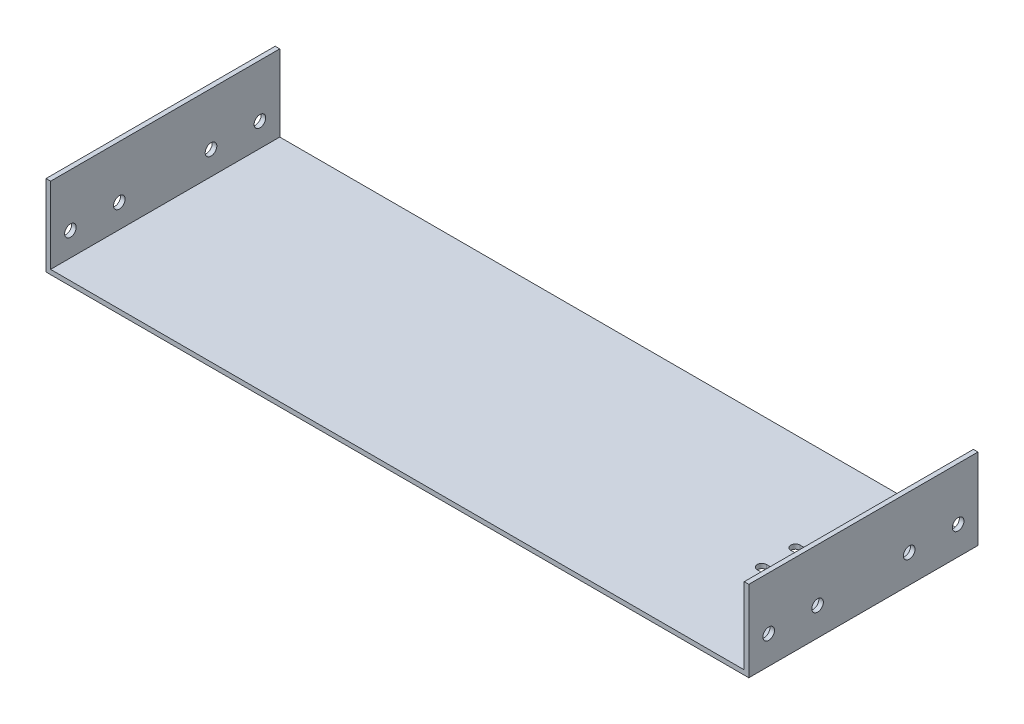
ISO-10303-21;
HEADER;
FILE_DESCRIPTION(('STEP AP214'),'2;1');
FILE_NAME('part.step','',(''),(''),'','','');
FILE_SCHEMA(('AUTOMOTIVE_DESIGN { 1 0 10303 214 1 1 1 1 }'));
ENDSEC;
DATA;
#1=APPLICATION_CONTEXT('core data for automotive mechanical design processes');
#2=APPLICATION_PROTOCOL_DEFINITION('international standard','automotive_design',2000,#1);
#3=PRODUCT_CONTEXT('',#1,'mechanical');
#4=PRODUCT('Part','Part','',(#3));
#5=PRODUCT_RELATED_PRODUCT_CATEGORY('part','',(#4));
#6=PRODUCT_DEFINITION_FORMATION('','',#4);
#7=PRODUCT_DEFINITION_CONTEXT('part definition',#1,'design');
#8=PRODUCT_DEFINITION('design','',#6,#7);
#9=PRODUCT_DEFINITION_SHAPE('','',#8);
#10=(LENGTH_UNIT() NAMED_UNIT(*) SI_UNIT(.MILLI.,.METRE.));
#11=(NAMED_UNIT(*) PLANE_ANGLE_UNIT() SI_UNIT($,.RADIAN.));
#12=(NAMED_UNIT(*) SI_UNIT($,.STERADIAN.) SOLID_ANGLE_UNIT());
#13=UNCERTAINTY_MEASURE_WITH_UNIT(LENGTH_MEASURE(1.E-05),#10,'distance_accuracy_value','');
#14=(GEOMETRIC_REPRESENTATION_CONTEXT(3) GLOBAL_UNCERTAINTY_ASSIGNED_CONTEXT((#13)) GLOBAL_UNIT_ASSIGNED_CONTEXT((#10,
#11,#12)) REPRESENTATION_CONTEXT('',''));
#15=CARTESIAN_POINT('',(0.,0.,0.));
#16=DIRECTION('',(0.,0.,1.));
#17=DIRECTION('',(1.,0.,0.));
#18=AXIS2_PLACEMENT_3D('',#15,#16,#17);
#19=CARTESIAN_POINT('',(0.,3.,0.));
#20=DIRECTION('',(0.,1.,0.));
#21=DIRECTION('',(0.,0.,1.));
#22=AXIS2_PLACEMENT_3D('',#19,#20,#21);
#23=PLANE('',#22);
#24=CARTESIAN_POINT('',(174.5,3.,11.0000000000001));
#25=DIRECTION('',(0.,1.,0.));
#26=DIRECTION('',(0.,0.,1.));
#27=AXIS2_PLACEMENT_3D('',#24,#25,#26);
#28=CIRCLE('',#27,2.99999999999999);
#29=CARTESIAN_POINT('',(174.5,3.,8.00000000000007));
#30=VERTEX_POINT('',#29);
#31=CARTESIAN_POINT('',(174.5,3.,14.0000000000001));
#32=VERTEX_POINT('',#31);
#33=EDGE_CURVE('E54',#30,#32,#28,.T.);
#34=ORIENTED_EDGE('',*,*,#33,.F.);
#35=DIRECTION('',(-1.,0.,0.));
#36=VECTOR('',#35,1.);
#37=CARTESIAN_POINT('',(0.,3.,8.00000000000007));
#38=LINE('',#37,#36);
#39=CARTESIAN_POINT('',(204.5,3.,8.00000000000007));
#40=VERTEX_POINT('',#39);
#41=EDGE_CURVE('E177',#40,#30,#38,.T.);
#42=ORIENTED_EDGE('',*,*,#41,.F.);
#43=CARTESIAN_POINT('',(204.5,3.,11.0000000000001));
#44=DIRECTION('',(0.,1.,0.));
#45=DIRECTION('',(0.,0.,1.));
#46=AXIS2_PLACEMENT_3D('',#43,#44,#45);
#47=CIRCLE('',#46,2.99999999999999);
#48=CARTESIAN_POINT('',(204.5,3.,14.0000000000001));
#49=VERTEX_POINT('',#48);
#50=EDGE_CURVE('E159',#49,#40,#47,.T.);
#51=ORIENTED_EDGE('',*,*,#50,.F.);
#52=DIRECTION('',(-1.,0.,0.));
#53=VECTOR('',#52,1.);
#54=CARTESIAN_POINT('',(0.,3.,14.0000000000001));
#55=LINE('',#54,#53);
#56=EDGE_CURVE('E170',#49,#32,#55,.T.);
#57=ORIENTED_EDGE('',*,*,#56,.T.);
#58=EDGE_LOOP('',(#34,#42,#51,#57));
#59=FACE_BOUND('',#58,.T.);
#60=CARTESIAN_POINT('',(204.5,3.,-10.9999999999999));
#61=DIRECTION('',(0.,1.,0.));
#62=DIRECTION('',(0.,0.,1.));
#63=AXIS2_PLACEMENT_3D('',#60,#61,#62);
#64=CIRCLE('',#63,3.00000000000002);
#65=CARTESIAN_POINT('',(204.5,3.,-7.99999999999994));
#66=VERTEX_POINT('',#65);
#67=CARTESIAN_POINT('',(204.5,3.,-13.9999999999999));
#68=VERTEX_POINT('',#67);
#69=EDGE_CURVE('E62',#66,#68,#64,.T.);
#70=ORIENTED_EDGE('',*,*,#69,.F.);
#71=DIRECTION('',(1.,0.,0.));
#72=VECTOR('',#71,1.);
#73=CARTESIAN_POINT('',(0.,3.,-7.99999999999994));
#74=LINE('',#73,#72);
#75=CARTESIAN_POINT('',(174.5,3.,-7.99999999999994));
#76=VERTEX_POINT('',#75);
#77=EDGE_CURVE('E202',#76,#66,#74,.T.);
#78=ORIENTED_EDGE('',*,*,#77,.F.);
#79=CARTESIAN_POINT('',(174.5,3.,-10.9999999999999));
#80=DIRECTION('',(0.,1.,0.));
#81=DIRECTION('',(0.,0.,1.));
#82=AXIS2_PLACEMENT_3D('',#79,#80,#81);
#83=CIRCLE('',#82,3.00000000000002);
#84=CARTESIAN_POINT('',(174.5,3.,-13.9999999999999));
#85=VERTEX_POINT('',#84);
#86=EDGE_CURVE('E198',#85,#76,#83,.T.);
#87=ORIENTED_EDGE('',*,*,#86,.F.);
#88=DIRECTION('',(1.,0.,0.));
#89=VECTOR('',#88,1.);
#90=CARTESIAN_POINT('',(0.,3.,-13.9999999999999));
#91=LINE('',#90,#89);
#92=EDGE_CURVE('E194',#85,#68,#91,.T.);
#93=ORIENTED_EDGE('',*,*,#92,.T.);
#94=EDGE_LOOP('',(#70,#78,#87,#93));
#95=FACE_BOUND('',#94,.T.);
#96=DIRECTION('',(1.,0.,0.));
#97=VECTOR('',#96,1.);
#98=CARTESIAN_POINT('',(-230.,3.,75.));
#99=LINE('',#98,#97);
#100=CARTESIAN_POINT('',(-227.,3.,75.));
#101=VERTEX_POINT('',#100);
#102=CARTESIAN_POINT('',(227.,3.,75.));
#103=VERTEX_POINT('',#102);
#104=EDGE_CURVE('E325',#101,#103,#99,.T.);
#105=ORIENTED_EDGE('',*,*,#104,.T.);
#106=DIRECTION('',(0.,0.,1.));
#107=VECTOR('',#106,1.);
#108=CARTESIAN_POINT('',(227.,3.,-75.));
#109=LINE('',#108,#107);
#110=CARTESIAN_POINT('',(227.,3.,-75.));
#111=VERTEX_POINT('',#110);
#112=EDGE_CURVE('E269',#111,#103,#109,.T.);
#113=ORIENTED_EDGE('',*,*,#112,.F.);
#114=DIRECTION('',(-1.,0.,0.));
#115=VECTOR('',#114,1.);
#116=CARTESIAN_POINT('',(-230.,3.,-75.));
#117=LINE('',#116,#115);
#118=CARTESIAN_POINT('',(-227.,3.,-75.));
#119=VERTEX_POINT('',#118);
#120=EDGE_CURVE('E322',#111,#119,#117,.T.);
#121=ORIENTED_EDGE('',*,*,#120,.T.);
#122=DIRECTION('',(0.,0.,-1.));
#123=VECTOR('',#122,1.);
#124=CARTESIAN_POINT('',(-227.,3.,-75.));
#125=LINE('',#124,#123);
#126=EDGE_CURVE('E295',#101,#119,#125,.T.);
#127=ORIENTED_EDGE('',*,*,#126,.F.);
#128=EDGE_LOOP('',(#105,#113,#121,#127));
#129=FACE_BOUND('',#128,.T.);
#130=ADVANCED_FACE('F38',(#59,#95,#129),#23,.T.);
#131=CARTESIAN_POINT('',(230.,3.,-75.));
#132=DIRECTION('',(-1.,0.,0.));
#133=DIRECTION('',(0.,0.,1.));
#134=AXIS2_PLACEMENT_3D('',#131,#132,#133);
#135=PLANE('',#134);
#136=CARTESIAN_POINT('',(230.,18.5,-62.));
#137=DIRECTION('',(1.,0.,0.));
#138=DIRECTION('',(0.,0.,-1.));
#139=AXIS2_PLACEMENT_3D('',#136,#137,#138);
#140=CIRCLE('',#139,3.79999999999999);
#141=CARTESIAN_POINT('',(230.,18.5,-65.8));
#142=VERTEX_POINT('',#141);
#143=EDGE_CURVE('E218',#142,#142,#140,.T.);
#144=ORIENTED_EDGE('',*,*,#143,.F.);
#145=EDGE_LOOP('',(#144));
#146=FACE_BOUND('',#145,.T.);
#147=CARTESIAN_POINT('',(230.,18.5,30.));
#148=DIRECTION('',(1.,0.,0.));
#149=DIRECTION('',(0.,0.,-1.));
#150=AXIS2_PLACEMENT_3D('',#147,#148,#149);
#151=CIRCLE('',#150,3.79999999999999);
#152=CARTESIAN_POINT('',(230.,18.5,26.2));
#153=VERTEX_POINT('',#152);
#154=EDGE_CURVE('E187',#153,#153,#151,.T.);
#155=ORIENTED_EDGE('',*,*,#154,.F.);
#156=EDGE_LOOP('',(#155));
#157=FACE_BOUND('',#156,.T.);
#158=CARTESIAN_POINT('',(230.,18.5,62.));
#159=DIRECTION('',(1.,0.,0.));
#160=DIRECTION('',(0.,0.,-1.));
#161=AXIS2_PLACEMENT_3D('',#158,#159,#160);
#162=CIRCLE('',#161,3.79999999999998);
#163=CARTESIAN_POINT('',(230.,18.5,58.2));
#164=VERTEX_POINT('',#163);
#165=EDGE_CURVE('E235',#164,#164,#162,.T.);
#166=ORIENTED_EDGE('',*,*,#165,.F.);
#167=EDGE_LOOP('',(#166));
#168=FACE_BOUND('',#167,.T.);
#169=CARTESIAN_POINT('',(230.,18.5,-30.));
#170=DIRECTION('',(1.,0.,0.));
#171=DIRECTION('',(0.,0.,-1.));
#172=AXIS2_PLACEMENT_3D('',#169,#170,#171);
#173=CIRCLE('',#172,3.79999999999999);
#174=CARTESIAN_POINT('',(230.,18.5,-33.8));
#175=VERTEX_POINT('',#174);
#176=EDGE_CURVE('E236',#175,#175,#173,.T.);
#177=ORIENTED_EDGE('',*,*,#176,.F.);
#178=EDGE_LOOP('',(#177));
#179=FACE_BOUND('',#178,.T.);
#180=DIRECTION('',(0.,0.,-1.));
#181=VECTOR('',#180,1.);
#182=CARTESIAN_POINT('',(230.,0.,-75.));
#183=LINE('',#182,#181);
#184=CARTESIAN_POINT('',(230.,0.,75.));
#185=VERTEX_POINT('',#184);
#186=CARTESIAN_POINT('',(230.,0.,-75.));
#187=VERTEX_POINT('',#186);
#188=EDGE_CURVE('E321',#185,#187,#183,.T.);
#189=ORIENTED_EDGE('',*,*,#188,.T.);
#190=DIRECTION('',(0.,-1.,0.));
#191=VECTOR('',#190,1.);
#192=CARTESIAN_POINT('',(230.,3.,-75.));
#193=LINE('',#192,#191);
#194=CARTESIAN_POINT('',(230.,53.,-75.));
#195=VERTEX_POINT('',#194);
#196=EDGE_CURVE('E352',#195,#187,#193,.T.);
#197=ORIENTED_EDGE('',*,*,#196,.F.);
#198=DIRECTION('',(0.,0.,-1.));
#199=VECTOR('',#198,1.);
#200=CARTESIAN_POINT('',(230.,53.,-75.));
#201=LINE('',#200,#199);
#202=CARTESIAN_POINT('',(230.,53.,75.));
#203=VERTEX_POINT('',#202);
#204=EDGE_CURVE('E270',#203,#195,#201,.T.);
#205=ORIENTED_EDGE('',*,*,#204,.F.);
#206=DIRECTION('',(0.,-1.,0.));
#207=VECTOR('',#206,1.);
#208=CARTESIAN_POINT('',(230.,3.,75.));
#209=LINE('',#208,#207);
#210=EDGE_CURVE('E329',#203,#185,#209,.T.);
#211=ORIENTED_EDGE('',*,*,#210,.T.);
#212=EDGE_LOOP('',(#189,#197,#205,#211));
#213=FACE_BOUND('',#212,.T.);
#214=ADVANCED_FACE('F40',(#146,#157,#168,#179,#213),#135,.F.);
#215=CARTESIAN_POINT('',(-230.,3.,-75.));
#216=DIRECTION('',(0.,0.,1.));
#217=DIRECTION('',(1.,0.,0.));
#218=AXIS2_PLACEMENT_3D('',#215,#216,#217);
#219=PLANE('',#218);
#220=DIRECTION('',(-1.,0.,0.));
#221=VECTOR('',#220,1.);
#222=CARTESIAN_POINT('',(-230.,0.,-75.));
#223=LINE('',#222,#221);
#224=CARTESIAN_POINT('',(-230.,0.,-75.));
#225=VERTEX_POINT('',#224);
#226=EDGE_CURVE('E333',#187,#225,#223,.T.);
#227=ORIENTED_EDGE('',*,*,#226,.T.);
#228=DIRECTION('',(0.,-1.,0.));
#229=VECTOR('',#228,1.);
#230=CARTESIAN_POINT('',(-230.,3.,-75.));
#231=LINE('',#230,#229);
#232=CARTESIAN_POINT('',(-230.,53.,-75.));
#233=VERTEX_POINT('',#232);
#234=EDGE_CURVE('E348',#233,#225,#231,.T.);
#235=ORIENTED_EDGE('',*,*,#234,.F.);
#236=DIRECTION('',(-1.,0.,0.));
#237=VECTOR('',#236,1.);
#238=CARTESIAN_POINT('',(-230.,53.,-75.));
#239=LINE('',#238,#237);
#240=CARTESIAN_POINT('',(-227.,53.,-75.));
#241=VERTEX_POINT('',#240);
#242=EDGE_CURVE('E306',#241,#233,#239,.T.);
#243=ORIENTED_EDGE('',*,*,#242,.F.);
#244=DIRECTION('',(0.,-1.,0.));
#245=VECTOR('',#244,1.);
#246=CARTESIAN_POINT('',(-227.,53.,-75.));
#247=LINE('',#246,#245);
#248=EDGE_CURVE('E310',#241,#119,#247,.T.);
#249=ORIENTED_EDGE('',*,*,#248,.T.);
#250=ORIENTED_EDGE('',*,*,#120,.F.);
#251=DIRECTION('',(0.,-1.,0.));
#252=VECTOR('',#251,1.);
#253=CARTESIAN_POINT('',(227.,53.,-75.));
#254=LINE('',#253,#252);
#255=CARTESIAN_POINT('',(227.,53.,-75.));
#256=VERTEX_POINT('',#255);
#257=EDGE_CURVE('E291',#256,#111,#254,.T.);
#258=ORIENTED_EDGE('',*,*,#257,.F.);
#259=DIRECTION('',(-1.,0.,0.));
#260=VECTOR('',#259,1.);
#261=CARTESIAN_POINT('',(230.,53.,-75.));
#262=LINE('',#261,#260);
#263=EDGE_CURVE('E274',#195,#256,#262,.T.);
#264=ORIENTED_EDGE('',*,*,#263,.F.);
#265=ORIENTED_EDGE('',*,*,#196,.T.);
#266=EDGE_LOOP('',(#227,#235,#243,#249,#250,#258,#264,#265));
#267=FACE_BOUND('',#266,.T.);
#268=ADVANCED_FACE('F416',(#267),#219,.F.);
#269=CARTESIAN_POINT('',(-230.,3.,-75.));
#270=DIRECTION('',(1.,0.,0.));
#271=DIRECTION('',(0.,0.,-1.));
#272=AXIS2_PLACEMENT_3D('',#269,#270,#271);
#273=PLANE('',#272);
#274=CARTESIAN_POINT('',(-230.,18.5,-62.));
#275=DIRECTION('',(1.,0.,0.));
#276=DIRECTION('',(0.,0.,-1.));
#277=AXIS2_PLACEMENT_3D('',#274,#275,#276);
#278=CIRCLE('',#277,3.79999999999999);
#279=CARTESIAN_POINT('',(-230.,18.5,-65.8));
#280=VERTEX_POINT('',#279);
#281=EDGE_CURVE('E222',#280,#280,#278,.T.);
#282=ORIENTED_EDGE('',*,*,#281,.T.);
#283=EDGE_LOOP('',(#282));
#284=FACE_BOUND('',#283,.T.);
#285=CARTESIAN_POINT('',(-230.,18.5,30.));
#286=DIRECTION('',(1.,0.,0.));
#287=DIRECTION('',(0.,0.,-1.));
#288=AXIS2_PLACEMENT_3D('',#285,#286,#287);
#289=CIRCLE('',#288,3.79999999999999);
#290=CARTESIAN_POINT('',(-230.,18.5,26.2));
#291=VERTEX_POINT('',#290);
#292=EDGE_CURVE('E231',#291,#291,#289,.T.);
#293=ORIENTED_EDGE('',*,*,#292,.T.);
#294=EDGE_LOOP('',(#293));
#295=FACE_BOUND('',#294,.T.);
#296=CARTESIAN_POINT('',(-230.,18.5,62.));
#297=DIRECTION('',(1.,0.,0.));
#298=DIRECTION('',(0.,0.,-1.));
#299=AXIS2_PLACEMENT_3D('',#296,#297,#298);
#300=CIRCLE('',#299,3.79999999999998);
#301=CARTESIAN_POINT('',(-230.,18.5,58.2));
#302=VERTEX_POINT('',#301);
#303=EDGE_CURVE('E240',#302,#302,#300,.T.);
#304=ORIENTED_EDGE('',*,*,#303,.T.);
#305=EDGE_LOOP('',(#304));
#306=FACE_BOUND('',#305,.T.);
#307=CARTESIAN_POINT('',(-230.,18.5,-30.));
#308=DIRECTION('',(1.,0.,0.));
#309=DIRECTION('',(0.,0.,-1.));
#310=AXIS2_PLACEMENT_3D('',#307,#308,#309);
#311=CIRCLE('',#310,3.79999999999999);
#312=CARTESIAN_POINT('',(-230.,18.5,-33.8));
#313=VERTEX_POINT('',#312);
#314=EDGE_CURVE('E223',#313,#313,#311,.T.);
#315=ORIENTED_EDGE('',*,*,#314,.T.);
#316=EDGE_LOOP('',(#315));
#317=FACE_BOUND('',#316,.T.);
#318=DIRECTION('',(0.,0.,1.));
#319=VECTOR('',#318,1.);
#320=CARTESIAN_POINT('',(-230.,0.,-75.));
#321=LINE('',#320,#319);
#322=CARTESIAN_POINT('',(-230.,0.,75.));
#323=VERTEX_POINT('',#322);
#324=EDGE_CURVE('E336',#225,#323,#321,.T.);
#325=ORIENTED_EDGE('',*,*,#324,.T.);
#326=DIRECTION('',(0.,-1.,0.));
#327=VECTOR('',#326,1.);
#328=CARTESIAN_POINT('',(-230.,3.,75.));
#329=LINE('',#328,#327);
#330=CARTESIAN_POINT('',(-230.,53.,75.));
#331=VERTEX_POINT('',#330);
#332=EDGE_CURVE('E344',#331,#323,#329,.T.);
#333=ORIENTED_EDGE('',*,*,#332,.F.);
#334=DIRECTION('',(0.,0.,1.));
#335=VECTOR('',#334,1.);
#336=CARTESIAN_POINT('',(-230.,53.,-75.));
#337=LINE('',#336,#335);
#338=EDGE_CURVE('E296',#233,#331,#337,.T.);
#339=ORIENTED_EDGE('',*,*,#338,.F.);
#340=ORIENTED_EDGE('',*,*,#234,.T.);
#341=EDGE_LOOP('',(#325,#333,#339,#340));
#342=FACE_BOUND('',#341,.T.);
#343=ADVANCED_FACE('F426',(#284,#295,#306,#317,#342),#273,.F.);
#344=CARTESIAN_POINT('',(-230.,3.,75.));
#345=DIRECTION('',(0.,0.,-1.));
#346=DIRECTION('',(-1.,0.,0.));
#347=AXIS2_PLACEMENT_3D('',#344,#345,#346);
#348=PLANE('',#347);
#349=DIRECTION('',(1.,0.,0.));
#350=VECTOR('',#349,1.);
#351=CARTESIAN_POINT('',(-230.,0.,75.));
#352=LINE('',#351,#350);
#353=EDGE_CURVE('E326',#323,#185,#352,.T.);
#354=ORIENTED_EDGE('',*,*,#353,.T.);
#355=ORIENTED_EDGE('',*,*,#210,.F.);
#356=DIRECTION('',(1.,0.,0.));
#357=VECTOR('',#356,1.);
#358=CARTESIAN_POINT('',(230.,53.,75.));
#359=LINE('',#358,#357);
#360=CARTESIAN_POINT('',(227.,53.,75.));
#361=VERTEX_POINT('',#360);
#362=EDGE_CURVE('E280',#361,#203,#359,.T.);
#363=ORIENTED_EDGE('',*,*,#362,.F.);
#364=DIRECTION('',(0.,-1.,0.));
#365=VECTOR('',#364,1.);
#366=CARTESIAN_POINT('',(227.,53.,75.));
#367=LINE('',#366,#365);
#368=EDGE_CURVE('E284',#361,#103,#367,.T.);
#369=ORIENTED_EDGE('',*,*,#368,.T.);
#370=ORIENTED_EDGE('',*,*,#104,.F.);
#371=DIRECTION('',(0.,-1.,0.));
#372=VECTOR('',#371,1.);
#373=CARTESIAN_POINT('',(-227.,53.,75.));
#374=LINE('',#373,#372);
#375=CARTESIAN_POINT('',(-227.,53.,75.));
#376=VERTEX_POINT('',#375);
#377=EDGE_CURVE('E317',#376,#101,#374,.T.);
#378=ORIENTED_EDGE('',*,*,#377,.F.);
#379=DIRECTION('',(1.,0.,0.));
#380=VECTOR('',#379,1.);
#381=CARTESIAN_POINT('',(-230.,53.,75.));
#382=LINE('',#381,#380);
#383=EDGE_CURVE('E300',#331,#376,#382,.T.);
#384=ORIENTED_EDGE('',*,*,#383,.F.);
#385=ORIENTED_EDGE('',*,*,#332,.T.);
#386=EDGE_LOOP('',(#354,#355,#363,#369,#370,#378,#384,#385));
#387=FACE_BOUND('',#386,.T.);
#388=ADVANCED_FACE('F423',(#387),#348,.F.);
#389=CARTESIAN_POINT('',(0.,0.,0.));
#390=DIRECTION('',(0.,1.,0.));
#391=DIRECTION('',(0.,0.,1.));
#392=AXIS2_PLACEMENT_3D('',#389,#390,#391);
#393=PLANE('',#392);
#394=DIRECTION('',(-1.,0.,0.));
#395=VECTOR('',#394,1.);
#396=CARTESIAN_POINT('',(0.,0.,8.00000000000007));
#397=LINE('',#396,#395);
#398=CARTESIAN_POINT('',(204.5,0.,8.00000000000007));
#399=VERTEX_POINT('',#398);
#400=CARTESIAN_POINT('',(174.5,0.,8.00000000000007));
#401=VERTEX_POINT('',#400);
#402=EDGE_CURVE('E47',#399,#401,#397,.T.);
#403=ORIENTED_EDGE('',*,*,#402,.T.);
#404=CARTESIAN_POINT('',(174.5,0.,11.0000000000001));
#405=DIRECTION('',(0.,1.,0.));
#406=DIRECTION('',(0.,0.,1.));
#407=AXIS2_PLACEMENT_3D('',#404,#405,#406);
#408=CIRCLE('',#407,2.99999999999999);
#409=CARTESIAN_POINT('',(174.5,0.,14.0000000000001));
#410=VERTEX_POINT('',#409);
#411=EDGE_CURVE('E11',#401,#410,#408,.T.);
#412=ORIENTED_EDGE('',*,*,#411,.T.);
#413=DIRECTION('',(-1.,0.,0.));
#414=VECTOR('',#413,1.);
#415=CARTESIAN_POINT('',(0.,0.,14.0000000000001));
#416=LINE('',#415,#414);
#417=CARTESIAN_POINT('',(204.5,0.,14.0000000000001));
#418=VERTEX_POINT('',#417);
#419=EDGE_CURVE('E383',#418,#410,#416,.T.);
#420=ORIENTED_EDGE('',*,*,#419,.F.);
#421=CARTESIAN_POINT('',(204.5,0.,11.0000000000001));
#422=DIRECTION('',(0.,1.,0.));
#423=DIRECTION('',(0.,0.,1.));
#424=AXIS2_PLACEMENT_3D('',#421,#422,#423);
#425=CIRCLE('',#424,2.99999999999999);
#426=EDGE_CURVE('E162',#418,#399,#425,.T.);
#427=ORIENTED_EDGE('',*,*,#426,.T.);
#428=EDGE_LOOP('',(#403,#412,#420,#427));
#429=FACE_BOUND('',#428,.T.);
#430=DIRECTION('',(1.,0.,0.));
#431=VECTOR('',#430,1.);
#432=CARTESIAN_POINT('',(0.,0.,-7.99999999999994));
#433=LINE('',#432,#431);
#434=CARTESIAN_POINT('',(174.5,0.,-7.99999999999994));
#435=VERTEX_POINT('',#434);
#436=CARTESIAN_POINT('',(204.5,0.,-7.99999999999994));
#437=VERTEX_POINT('',#436);
#438=EDGE_CURVE('E375',#435,#437,#433,.T.);
#439=ORIENTED_EDGE('',*,*,#438,.T.);
#440=CARTESIAN_POINT('',(204.5,0.,-10.9999999999999));
#441=DIRECTION('',(0.,1.,0.));
#442=DIRECTION('',(0.,0.,1.));
#443=AXIS2_PLACEMENT_3D('',#440,#441,#442);
#444=CIRCLE('',#443,3.00000000000002);
#445=CARTESIAN_POINT('',(204.5,0.,-13.9999999999999));
#446=VERTEX_POINT('',#445);
#447=EDGE_CURVE('E379',#437,#446,#444,.T.);
#448=ORIENTED_EDGE('',*,*,#447,.T.);
#449=DIRECTION('',(1.,0.,0.));
#450=VECTOR('',#449,1.);
#451=CARTESIAN_POINT('',(0.,0.,-13.9999999999999));
#452=LINE('',#451,#450);
#453=CARTESIAN_POINT('',(174.5,0.,-13.9999999999999));
#454=VERTEX_POINT('',#453);
#455=EDGE_CURVE('E356',#454,#446,#452,.T.);
#456=ORIENTED_EDGE('',*,*,#455,.F.);
#457=CARTESIAN_POINT('',(174.5,0.,-10.9999999999999));
#458=DIRECTION('',(0.,1.,0.));
#459=DIRECTION('',(0.,0.,1.));
#460=AXIS2_PLACEMENT_3D('',#457,#458,#459);
#461=CIRCLE('',#460,3.00000000000002);
#462=EDGE_CURVE('E371',#454,#435,#461,.T.);
#463=ORIENTED_EDGE('',*,*,#462,.T.);
#464=EDGE_LOOP('',(#439,#448,#456,#463));
#465=FACE_BOUND('',#464,.T.);
#466=ORIENTED_EDGE('',*,*,#188,.F.);
#467=ORIENTED_EDGE('',*,*,#353,.F.);
#468=ORIENTED_EDGE('',*,*,#324,.F.);
#469=ORIENTED_EDGE('',*,*,#226,.F.);
#470=EDGE_LOOP('',(#466,#467,#468,#469));
#471=FACE_BOUND('',#470,.T.);
#472=ADVANCED_FACE('F390',(#429,#465,#471),#393,.F.);
#473=CARTESIAN_POINT('',(-227.,53.,-75.));
#474=DIRECTION('',(-1.,0.,0.));
#475=DIRECTION('',(0.,0.,1.));
#476=AXIS2_PLACEMENT_3D('',#473,#474,#475);
#477=PLANE('',#476);
#478=CARTESIAN_POINT('',(-227.,18.5,-62.));
#479=DIRECTION('',(-1.,0.,0.));
#480=DIRECTION('',(0.,0.,1.));
#481=AXIS2_PLACEMENT_3D('',#478,#479,#480);
#482=CIRCLE('',#481,3.79999999999999);
#483=CARTESIAN_POINT('',(-227.,18.5,-58.2000000000001));
#484=VERTEX_POINT('',#483);
#485=EDGE_CURVE('E265',#484,#484,#482,.T.);
#486=ORIENTED_EDGE('',*,*,#485,.T.);
#487=EDGE_LOOP('',(#486));
#488=FACE_BOUND('',#487,.T.);
#489=CARTESIAN_POINT('',(-227.,18.5,30.));
#490=DIRECTION('',(-1.,0.,0.));
#491=DIRECTION('',(0.,0.,1.));
#492=AXIS2_PLACEMENT_3D('',#489,#490,#491);
#493=CIRCLE('',#492,3.79999999999999);
#494=CARTESIAN_POINT('',(-227.,18.5,33.8));
#495=VERTEX_POINT('',#494);
#496=EDGE_CURVE('E260',#495,#495,#493,.T.);
#497=ORIENTED_EDGE('',*,*,#496,.T.);
#498=EDGE_LOOP('',(#497));
#499=FACE_BOUND('',#498,.T.);
#500=CARTESIAN_POINT('',(-227.,18.5,62.));
#501=DIRECTION('',(-1.,0.,0.));
#502=DIRECTION('',(0.,0.,1.));
#503=AXIS2_PLACEMENT_3D('',#500,#501,#502);
#504=CIRCLE('',#503,3.79999999999998);
#505=CARTESIAN_POINT('',(-227.,18.5,65.8));
#506=VERTEX_POINT('',#505);
#507=EDGE_CURVE('E255',#506,#506,#504,.T.);
#508=ORIENTED_EDGE('',*,*,#507,.T.);
#509=EDGE_LOOP('',(#508));
#510=FACE_BOUND('',#509,.T.);
#511=CARTESIAN_POINT('',(-227.,18.5,-30.));
#512=DIRECTION('',(-1.,0.,0.));
#513=DIRECTION('',(0.,0.,1.));
#514=AXIS2_PLACEMENT_3D('',#511,#512,#513);
#515=CIRCLE('',#514,3.79999999999999);
#516=CARTESIAN_POINT('',(-227.,18.5,-26.2));
#517=VERTEX_POINT('',#516);
#518=EDGE_CURVE('E250',#517,#517,#515,.T.);
#519=ORIENTED_EDGE('',*,*,#518,.T.);
#520=EDGE_LOOP('',(#519));
#521=FACE_BOUND('',#520,.T.);
#522=ORIENTED_EDGE('',*,*,#126,.T.);
#523=ORIENTED_EDGE('',*,*,#248,.F.);
#524=DIRECTION('',(0.,0.,-1.));
#525=VECTOR('',#524,1.);
#526=CARTESIAN_POINT('',(-227.,53.,-75.));
#527=LINE('',#526,#525);
#528=EDGE_CURVE('E303',#376,#241,#527,.T.);
#529=ORIENTED_EDGE('',*,*,#528,.F.);
#530=ORIENTED_EDGE('',*,*,#377,.T.);
#531=EDGE_LOOP('',(#522,#523,#529,#530));
#532=FACE_BOUND('',#531,.T.);
#533=ADVANCED_FACE('F420',(#488,#499,#510,#521,#532),#477,.F.);
#534=CARTESIAN_POINT('',(0.,53.,0.));
#535=DIRECTION('',(0.,1.,0.));
#536=DIRECTION('',(0.,0.,1.));
#537=AXIS2_PLACEMENT_3D('',#534,#535,#536);
#538=PLANE('',#537);
#539=ORIENTED_EDGE('',*,*,#338,.T.);
#540=ORIENTED_EDGE('',*,*,#383,.T.);
#541=ORIENTED_EDGE('',*,*,#528,.T.);
#542=ORIENTED_EDGE('',*,*,#242,.T.);
#543=EDGE_LOOP('',(#539,#540,#541,#542));
#544=FACE_BOUND('',#543,.T.);
#545=ADVANCED_FACE('F463',(#544),#538,.T.);
#546=CARTESIAN_POINT('',(227.,53.,-75.));
#547=DIRECTION('',(1.,0.,0.));
#548=DIRECTION('',(0.,0.,-1.));
#549=AXIS2_PLACEMENT_3D('',#546,#547,#548);
#550=PLANE('',#549);
#551=CARTESIAN_POINT('',(227.,18.5,-62.));
#552=DIRECTION('',(1.,0.,0.));
#553=DIRECTION('',(0.,0.,-1.));
#554=AXIS2_PLACEMENT_3D('',#551,#552,#553);
#555=CIRCLE('',#554,3.79999999999999);
#556=CARTESIAN_POINT('',(227.,18.5,-65.8));
#557=VERTEX_POINT('',#556);
#558=EDGE_CURVE('E264',#557,#557,#555,.T.);
#559=ORIENTED_EDGE('',*,*,#558,.T.);
#560=EDGE_LOOP('',(#559));
#561=FACE_BOUND('',#560,.T.);
#562=CARTESIAN_POINT('',(227.,18.5,30.));
#563=DIRECTION('',(1.,0.,0.));
#564=DIRECTION('',(0.,0.,-1.));
#565=AXIS2_PLACEMENT_3D('',#562,#563,#564);
#566=CIRCLE('',#565,3.79999999999999);
#567=CARTESIAN_POINT('',(227.,18.5,26.2));
#568=VERTEX_POINT('',#567);
#569=EDGE_CURVE('E259',#568,#568,#566,.T.);
#570=ORIENTED_EDGE('',*,*,#569,.T.);
#571=EDGE_LOOP('',(#570));
#572=FACE_BOUND('',#571,.T.);
#573=CARTESIAN_POINT('',(227.,18.5,62.));
#574=DIRECTION('',(1.,0.,0.));
#575=DIRECTION('',(0.,0.,-1.));
#576=AXIS2_PLACEMENT_3D('',#573,#574,#575);
#577=CIRCLE('',#576,3.79999999999998);
#578=CARTESIAN_POINT('',(227.,18.5,58.2));
#579=VERTEX_POINT('',#578);
#580=EDGE_CURVE('E254',#579,#579,#577,.T.);
#581=ORIENTED_EDGE('',*,*,#580,.T.);
#582=EDGE_LOOP('',(#581));
#583=FACE_BOUND('',#582,.T.);
#584=CARTESIAN_POINT('',(227.,18.5,-30.));
#585=DIRECTION('',(1.,0.,0.));
#586=DIRECTION('',(0.,0.,-1.));
#587=AXIS2_PLACEMENT_3D('',#584,#585,#586);
#588=CIRCLE('',#587,3.79999999999999);
#589=CARTESIAN_POINT('',(227.,18.5,-33.8));
#590=VERTEX_POINT('',#589);
#591=EDGE_CURVE('E227',#590,#590,#588,.T.);
#592=ORIENTED_EDGE('',*,*,#591,.T.);
#593=EDGE_LOOP('',(#592));
#594=FACE_BOUND('',#593,.T.);
#595=ORIENTED_EDGE('',*,*,#112,.T.);
#596=ORIENTED_EDGE('',*,*,#368,.F.);
#597=DIRECTION('',(0.,0.,1.));
#598=VECTOR('',#597,1.);
#599=CARTESIAN_POINT('',(227.,53.,-75.));
#600=LINE('',#599,#598);
#601=EDGE_CURVE('E277',#256,#361,#600,.T.);
#602=ORIENTED_EDGE('',*,*,#601,.F.);
#603=ORIENTED_EDGE('',*,*,#257,.T.);
#604=EDGE_LOOP('',(#595,#596,#602,#603));
#605=FACE_BOUND('',#604,.T.);
#606=ADVANCED_FACE('F456',(#561,#572,#583,#594,#605),#550,.F.);
#607=CARTESIAN_POINT('',(0.,53.,0.));
#608=DIRECTION('',(0.,-1.,0.));
#609=DIRECTION('',(0.,0.,-1.));
#610=AXIS2_PLACEMENT_3D('',#607,#608,#609);
#611=PLANE('',#610);
#612=ORIENTED_EDGE('',*,*,#204,.T.);
#613=ORIENTED_EDGE('',*,*,#263,.T.);
#614=ORIENTED_EDGE('',*,*,#601,.T.);
#615=ORIENTED_EDGE('',*,*,#362,.T.);
#616=EDGE_LOOP('',(#612,#613,#614,#615));
#617=FACE_BOUND('',#616,.T.);
#618=ADVANCED_FACE('F449',(#617),#611,.F.);
#619=CARTESIAN_POINT('',(-230.,18.5,-30.));
#620=DIRECTION('',(1.,0.,0.));
#621=DIRECTION('',(0.,0.,-1.));
#622=AXIS2_PLACEMENT_3D('',#619,#620,#621);
#623=CYLINDRICAL_SURFACE('',#622,3.79999999999999);
#624=ORIENTED_EDGE('',*,*,#176,.T.);
#625=EDGE_LOOP('',(#624));
#626=FACE_BOUND('',#625,.T.);
#627=ORIENTED_EDGE('',*,*,#591,.F.);
#628=EDGE_LOOP('',(#627));
#629=FACE_BOUND('',#628,.T.);
#630=ADVANCED_FACE('F477',(#626,#629),#623,.F.);
#631=CARTESIAN_POINT('',(-230.,18.5,62.));
#632=DIRECTION('',(1.,0.,0.));
#633=DIRECTION('',(0.,0.,-1.));
#634=AXIS2_PLACEMENT_3D('',#631,#632,#633);
#635=CYLINDRICAL_SURFACE('',#634,3.79999999999998);
#636=ORIENTED_EDGE('',*,*,#165,.T.);
#637=EDGE_LOOP('',(#636));
#638=FACE_BOUND('',#637,.T.);
#639=ORIENTED_EDGE('',*,*,#580,.F.);
#640=EDGE_LOOP('',(#639));
#641=FACE_BOUND('',#640,.T.);
#642=ADVANCED_FACE('F484',(#638,#641),#635,.F.);
#643=CARTESIAN_POINT('',(-230.,18.5,30.));
#644=DIRECTION('',(1.,0.,0.));
#645=DIRECTION('',(0.,0.,-1.));
#646=AXIS2_PLACEMENT_3D('',#643,#644,#645);
#647=CYLINDRICAL_SURFACE('',#646,3.79999999999999);
#648=ORIENTED_EDGE('',*,*,#154,.T.);
#649=EDGE_LOOP('',(#648));
#650=FACE_BOUND('',#649,.T.);
#651=ORIENTED_EDGE('',*,*,#569,.F.);
#652=EDGE_LOOP('',(#651));
#653=FACE_BOUND('',#652,.T.);
#654=ADVANCED_FACE('F493',(#650,#653),#647,.F.);
#655=CARTESIAN_POINT('',(-230.,18.5,-62.));
#656=DIRECTION('',(1.,0.,0.));
#657=DIRECTION('',(0.,0.,-1.));
#658=AXIS2_PLACEMENT_3D('',#655,#656,#657);
#659=CYLINDRICAL_SURFACE('',#658,3.79999999999999);
#660=ORIENTED_EDGE('',*,*,#143,.T.);
#661=EDGE_LOOP('',(#660));
#662=FACE_BOUND('',#661,.T.);
#663=ORIENTED_EDGE('',*,*,#558,.F.);
#664=EDGE_LOOP('',(#663));
#665=FACE_BOUND('',#664,.T.);
#666=ADVANCED_FACE('F487',(#662,#665),#659,.F.);
#667=ORIENTED_EDGE('',*,*,#314,.F.);
#668=EDGE_LOOP('',(#667));
#669=FACE_BOUND('',#668,.T.);
#670=ORIENTED_EDGE('',*,*,#518,.F.);
#671=EDGE_LOOP('',(#670));
#672=FACE_BOUND('',#671,.T.);
#673=ADVANCED_FACE('F482',(#669,#672),#623,.F.);
#674=ORIENTED_EDGE('',*,*,#303,.F.);
#675=EDGE_LOOP('',(#674));
#676=FACE_BOUND('',#675,.T.);
#677=ORIENTED_EDGE('',*,*,#507,.F.);
#678=EDGE_LOOP('',(#677));
#679=FACE_BOUND('',#678,.T.);
#680=ADVANCED_FACE('F478',(#676,#679),#635,.F.);
#681=ORIENTED_EDGE('',*,*,#292,.F.);
#682=EDGE_LOOP('',(#681));
#683=FACE_BOUND('',#682,.T.);
#684=ORIENTED_EDGE('',*,*,#496,.F.);
#685=EDGE_LOOP('',(#684));
#686=FACE_BOUND('',#685,.T.);
#687=ADVANCED_FACE('F481',(#683,#686),#647,.F.);
#688=ORIENTED_EDGE('',*,*,#281,.F.);
#689=EDGE_LOOP('',(#688));
#690=FACE_BOUND('',#689,.T.);
#691=ORIENTED_EDGE('',*,*,#485,.F.);
#692=EDGE_LOOP('',(#691));
#693=FACE_BOUND('',#692,.T.);
#694=ADVANCED_FACE('F491',(#690,#693),#659,.F.);
#695=CARTESIAN_POINT('',(204.5,-7.,-10.9999999999999));
#696=DIRECTION('',(0.,1.,0.));
#697=DIRECTION('',(0.,0.,1.));
#698=AXIS2_PLACEMENT_3D('',#695,#696,#697);
#699=CYLINDRICAL_SURFACE('',#698,3.00000000000002);
#700=DIRECTION('',(0.,1.,0.));
#701=VECTOR('',#700,1.);
#702=CARTESIAN_POINT('',(204.5,-7.,-7.99999999999994));
#703=LINE('',#702,#701);
#704=EDGE_CURVE('E207',#437,#66,#703,.T.);
#705=ORIENTED_EDGE('',*,*,#704,.T.);
#706=ORIENTED_EDGE('',*,*,#69,.T.);
#707=DIRECTION('',(0.,1.,0.));
#708=VECTOR('',#707,1.);
#709=CARTESIAN_POINT('',(204.5,-7.,-13.9999999999999));
#710=LINE('',#709,#708);
#711=EDGE_CURVE('E206',#446,#68,#710,.T.);
#712=ORIENTED_EDGE('',*,*,#711,.F.);
#713=ORIENTED_EDGE('',*,*,#447,.F.);
#714=EDGE_LOOP('',(#705,#706,#712,#713));
#715=FACE_BOUND('',#714,.T.);
#716=ADVANCED_FACE('F496',(#715),#699,.F.);
#717=CARTESIAN_POINT('',(0.,-7.,-7.99999999999994));
#718=DIRECTION('',(0.,0.,1.));
#719=DIRECTION('',(1.,0.,0.));
#720=AXIS2_PLACEMENT_3D('',#717,#718,#719);
#721=PLANE('',#720);
#722=DIRECTION('',(0.,1.,0.));
#723=VECTOR('',#722,1.);
#724=CARTESIAN_POINT('',(174.5,-7.,-7.99999999999994));
#725=LINE('',#724,#723);
#726=EDGE_CURVE('E210',#435,#76,#725,.T.);
#727=ORIENTED_EDGE('',*,*,#726,.T.);
#728=ORIENTED_EDGE('',*,*,#77,.T.);
#729=ORIENTED_EDGE('',*,*,#704,.F.);
#730=ORIENTED_EDGE('',*,*,#438,.F.);
#731=EDGE_LOOP('',(#727,#728,#729,#730));
#732=FACE_BOUND('',#731,.T.);
#733=ADVANCED_FACE('F499',(#732),#721,.F.);
#734=CARTESIAN_POINT('',(174.5,-7.,-10.9999999999999));
#735=DIRECTION('',(0.,1.,0.));
#736=DIRECTION('',(0.,0.,1.));
#737=AXIS2_PLACEMENT_3D('',#734,#735,#736);
#738=CYLINDRICAL_SURFACE('',#737,3.00000000000002);
#739=DIRECTION('',(0.,1.,0.));
#740=VECTOR('',#739,1.);
#741=CARTESIAN_POINT('',(174.5,-7.,-13.9999999999999));
#742=LINE('',#741,#740);
#743=EDGE_CURVE('E213',#454,#85,#742,.T.);
#744=ORIENTED_EDGE('',*,*,#743,.T.);
#745=ORIENTED_EDGE('',*,*,#86,.T.);
#746=ORIENTED_EDGE('',*,*,#726,.F.);
#747=ORIENTED_EDGE('',*,*,#462,.F.);
#748=EDGE_LOOP('',(#744,#745,#746,#747));
#749=FACE_BOUND('',#748,.T.);
#750=ADVANCED_FACE('F404',(#749),#738,.F.);
#751=CARTESIAN_POINT('',(0.,-7.,-13.9999999999999));
#752=DIRECTION('',(0.,0.,1.));
#753=DIRECTION('',(1.,0.,0.));
#754=AXIS2_PLACEMENT_3D('',#751,#752,#753);
#755=PLANE('',#754);
#756=ORIENTED_EDGE('',*,*,#455,.T.);
#757=ORIENTED_EDGE('',*,*,#711,.T.);
#758=ORIENTED_EDGE('',*,*,#92,.F.);
#759=ORIENTED_EDGE('',*,*,#743,.F.);
#760=EDGE_LOOP('',(#756,#757,#758,#759));
#761=FACE_BOUND('',#760,.T.);
#762=ADVANCED_FACE('F397',(#761),#755,.T.);
#763=CARTESIAN_POINT('',(174.5,-7.,11.0000000000001));
#764=DIRECTION('',(0.,1.,0.));
#765=DIRECTION('',(0.,0.,1.));
#766=AXIS2_PLACEMENT_3D('',#763,#764,#765);
#767=CYLINDRICAL_SURFACE('',#766,2.99999999999999);
#768=DIRECTION('',(0.,1.,0.));
#769=VECTOR('',#768,1.);
#770=CARTESIAN_POINT('',(174.5,-7.,8.00000000000007));
#771=LINE('',#770,#769);
#772=EDGE_CURVE('E184',#401,#30,#771,.T.);
#773=ORIENTED_EDGE('',*,*,#772,.T.);
#774=ORIENTED_EDGE('',*,*,#33,.T.);
#775=DIRECTION('',(0.,1.,0.));
#776=VECTOR('',#775,1.);
#777=CARTESIAN_POINT('',(174.5,-7.,14.0000000000001));
#778=LINE('',#777,#776);
#779=EDGE_CURVE('E167',#410,#32,#778,.T.);
#780=ORIENTED_EDGE('',*,*,#779,.F.);
#781=ORIENTED_EDGE('',*,*,#411,.F.);
#782=EDGE_LOOP('',(#773,#774,#780,#781));
#783=FACE_BOUND('',#782,.T.);
#784=ADVANCED_FACE('F395',(#783),#767,.F.);
#785=CARTESIAN_POINT('',(0.,-7.,8.00000000000007));
#786=DIRECTION('',(0.,0.,-1.));
#787=DIRECTION('',(-1.,0.,0.));
#788=AXIS2_PLACEMENT_3D('',#785,#786,#787);
#789=PLANE('',#788);
#790=DIRECTION('',(0.,1.,0.));
#791=VECTOR('',#790,1.);
#792=CARTESIAN_POINT('',(204.5,-7.,8.00000000000007));
#793=LINE('',#792,#791);
#794=EDGE_CURVE('E166',#399,#40,#793,.T.);
#795=ORIENTED_EDGE('',*,*,#794,.T.);
#796=ORIENTED_EDGE('',*,*,#41,.T.);
#797=ORIENTED_EDGE('',*,*,#772,.F.);
#798=ORIENTED_EDGE('',*,*,#402,.F.);
#799=EDGE_LOOP('',(#795,#796,#797,#798));
#800=FACE_BOUND('',#799,.T.);
#801=ADVANCED_FACE('F394',(#800),#789,.F.);
#802=CARTESIAN_POINT('',(204.5,-7.,11.0000000000001));
#803=DIRECTION('',(0.,1.,0.));
#804=DIRECTION('',(0.,0.,1.));
#805=AXIS2_PLACEMENT_3D('',#802,#803,#804);
#806=CYLINDRICAL_SURFACE('',#805,2.99999999999999);
#807=DIRECTION('',(0.,1.,0.));
#808=VECTOR('',#807,1.);
#809=CARTESIAN_POINT('',(204.5,-7.,14.0000000000001));
#810=LINE('',#809,#808);
#811=EDGE_CURVE('E154',#418,#49,#810,.T.);
#812=ORIENTED_EDGE('',*,*,#811,.T.);
#813=ORIENTED_EDGE('',*,*,#50,.T.);
#814=ORIENTED_EDGE('',*,*,#794,.F.);
#815=ORIENTED_EDGE('',*,*,#426,.F.);
#816=EDGE_LOOP('',(#812,#813,#814,#815));
#817=FACE_BOUND('',#816,.T.);
#818=ADVANCED_FACE('F156',(#817),#806,.F.);
#819=CARTESIAN_POINT('',(0.,-7.,14.0000000000001));
#820=DIRECTION('',(0.,0.,-1.));
#821=DIRECTION('',(-1.,0.,0.));
#822=AXIS2_PLACEMENT_3D('',#819,#820,#821);
#823=PLANE('',#822);
#824=ORIENTED_EDGE('',*,*,#419,.T.);
#825=ORIENTED_EDGE('',*,*,#779,.T.);
#826=ORIENTED_EDGE('',*,*,#56,.F.);
#827=ORIENTED_EDGE('',*,*,#811,.F.);
#828=EDGE_LOOP('',(#824,#825,#826,#827));
#829=FACE_BOUND('',#828,.T.);
#830=ADVANCED_FACE('F171',(#829),#823,.T.);
#831=CLOSED_SHELL('',(#130,#214,#268,#343,#388,#472,#533,#545,#606,#618,#630,#642,#654,#666,
#673,#680,#687,#694,#716,#733,#750,#762,#784,#801,#818,#830));
#832=MANIFOLD_SOLID_BREP('B2',#831);
#833=ADVANCED_BREP_SHAPE_REPRESENTATION('',(#18,#832),#14);
#834=SHAPE_DEFINITION_REPRESENTATION(#9,#833);
ENDSEC;
END-ISO-10303-21;
